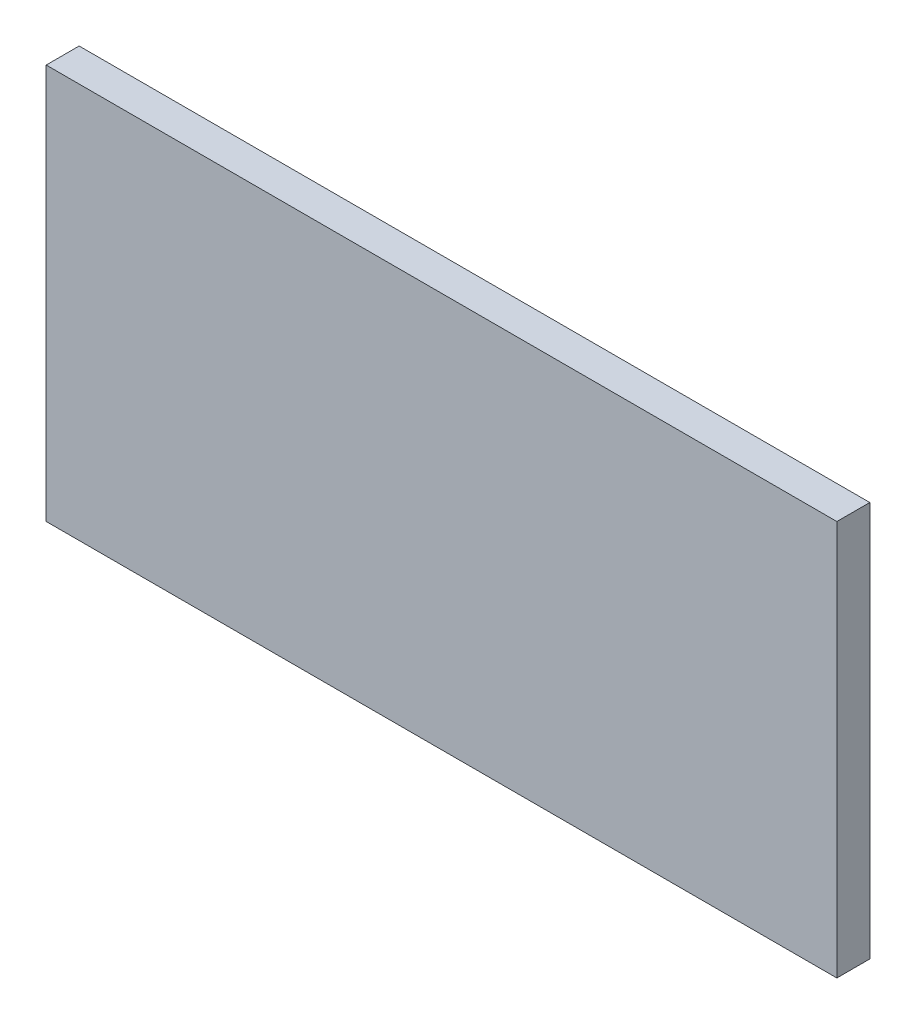
ISO-10303-21;
HEADER;
FILE_DESCRIPTION(('STEP AP214'),'2;1');
FILE_NAME('part.step','',(''),(''),'','','');
FILE_SCHEMA(('AUTOMOTIVE_DESIGN { 1 0 10303 214 1 1 1 1 }'));
ENDSEC;
DATA;
#1=APPLICATION_CONTEXT('core data for automotive mechanical design processes');
#2=APPLICATION_PROTOCOL_DEFINITION('international standard','automotive_design',2000,#1);
#3=PRODUCT_CONTEXT('',#1,'mechanical');
#4=PRODUCT('Part','Part','',(#3));
#5=PRODUCT_RELATED_PRODUCT_CATEGORY('part','',(#4));
#6=PRODUCT_DEFINITION_FORMATION('','',#4);
#7=PRODUCT_DEFINITION_CONTEXT('part definition',#1,'design');
#8=PRODUCT_DEFINITION('design','',#6,#7);
#9=PRODUCT_DEFINITION_SHAPE('','',#8);
#10=(LENGTH_UNIT() NAMED_UNIT(*) SI_UNIT(.MILLI.,.METRE.));
#11=(NAMED_UNIT(*) PLANE_ANGLE_UNIT() SI_UNIT($,.RADIAN.));
#12=(NAMED_UNIT(*) SI_UNIT($,.STERADIAN.) SOLID_ANGLE_UNIT());
#13=UNCERTAINTY_MEASURE_WITH_UNIT(LENGTH_MEASURE(1.E-05),#10,'distance_accuracy_value','');
#14=(GEOMETRIC_REPRESENTATION_CONTEXT(3) GLOBAL_UNCERTAINTY_ASSIGNED_CONTEXT((#13)) GLOBAL_UNIT_ASSIGNED_CONTEXT((#10,
#11,#12)) REPRESENTATION_CONTEXT('',''));
#15=CARTESIAN_POINT('',(0.,0.,0.));
#16=DIRECTION('',(0.,0.,1.));
#17=DIRECTION('',(1.,0.,0.));
#18=AXIS2_PLACEMENT_3D('',#15,#16,#17);
#19=CARTESIAN_POINT('',(-555.522580204597,0.,38.1));
#20=DIRECTION('',(0.,-1.,0.));
#21=DIRECTION('',(0.,0.,-1.));
#22=AXIS2_PLACEMENT_3D('',#19,#20,#21);
#23=PLANE('',#22);
#24=DIRECTION('',(-1.,0.,0.));
#25=VECTOR('',#24,1.);
#26=CARTESIAN_POINT('',(-555.522580204597,0.,0.));
#27=LINE('',#26,#25);
#28=CARTESIAN_POINT('',(0.,0.,0.));
#29=VERTEX_POINT('',#28);
#30=CARTESIAN_POINT('',(-914.4,0.,0.));
#31=VERTEX_POINT('',#30);
#32=EDGE_CURVE('E101',#29,#31,#27,.T.);
#33=ORIENTED_EDGE('',*,*,#32,.F.);
#34=DIRECTION('',(0.,0.,-1.));
#35=VECTOR('',#34,1.);
#36=CARTESIAN_POINT('',(0.,0.,38.1));
#37=LINE('',#36,#35);
#38=CARTESIAN_POINT('',(0.,0.,38.1));
#39=VERTEX_POINT('',#38);
#40=EDGE_CURVE('E10',#39,#29,#37,.T.);
#41=ORIENTED_EDGE('',*,*,#40,.F.);
#42=DIRECTION('',(-1.,0.,0.));
#43=VECTOR('',#42,1.);
#44=CARTESIAN_POINT('',(-555.522580204597,0.,38.1));
#45=LINE('',#44,#43);
#46=CARTESIAN_POINT('',(-914.4,0.,38.1));
#47=VERTEX_POINT('',#46);
#48=EDGE_CURVE('E79',#39,#47,#45,.T.);
#49=ORIENTED_EDGE('',*,*,#48,.T.);
#50=DIRECTION('',(0.,0.,-1.));
#51=VECTOR('',#50,1.);
#52=CARTESIAN_POINT('',(-914.4,0.,38.1));
#53=LINE('',#52,#51);
#54=EDGE_CURVE('E38',#47,#31,#53,.T.);
#55=ORIENTED_EDGE('',*,*,#54,.T.);
#56=EDGE_LOOP('',(#33,#41,#49,#55));
#57=FACE_BOUND('',#56,.T.);
#58=ADVANCED_FACE('F16',(#57),#23,.T.);
#59=CARTESIAN_POINT('',(0.,228.6,38.1));
#60=DIRECTION('',(-1.,0.,0.));
#61=DIRECTION('',(0.,0.,1.));
#62=AXIS2_PLACEMENT_3D('',#59,#60,#61);
#63=PLANE('',#62);
#64=DIRECTION('',(0.,1.,0.));
#65=VECTOR('',#64,1.);
#66=CARTESIAN_POINT('',(0.,228.6,0.));
#67=LINE('',#66,#65);
#68=CARTESIAN_POINT('',(0.,457.2,0.));
#69=VERTEX_POINT('',#68);
#70=EDGE_CURVE('E86',#29,#69,#67,.T.);
#71=ORIENTED_EDGE('',*,*,#70,.T.);
#72=DIRECTION('',(0.,0.,-1.));
#73=VECTOR('',#72,1.);
#74=CARTESIAN_POINT('',(0.,457.2,38.1));
#75=LINE('',#74,#73);
#76=CARTESIAN_POINT('',(0.,457.2,38.1));
#77=VERTEX_POINT('',#76);
#78=EDGE_CURVE('E25',#77,#69,#75,.T.);
#79=ORIENTED_EDGE('',*,*,#78,.F.);
#80=DIRECTION('',(0.,1.,0.));
#81=VECTOR('',#80,1.);
#82=CARTESIAN_POINT('',(0.,228.6,38.1));
#83=LINE('',#82,#81);
#84=EDGE_CURVE('E73',#39,#77,#83,.T.);
#85=ORIENTED_EDGE('',*,*,#84,.F.);
#86=ORIENTED_EDGE('',*,*,#40,.T.);
#87=EDGE_LOOP('',(#71,#79,#85,#86));
#88=FACE_BOUND('',#87,.T.);
#89=ADVANCED_FACE('F84',(#88),#63,.F.);
#90=CARTESIAN_POINT('',(-555.522580204597,457.2,38.1));
#91=DIRECTION('',(0.,-1.,0.));
#92=DIRECTION('',(0.,0.,-1.));
#93=AXIS2_PLACEMENT_3D('',#90,#91,#92);
#94=PLANE('',#93);
#95=DIRECTION('',(-1.,0.,0.));
#96=VECTOR('',#95,1.);
#97=CARTESIAN_POINT('',(-555.522580204597,457.2,0.));
#98=LINE('',#97,#96);
#99=CARTESIAN_POINT('',(-914.4,457.2,0.));
#100=VERTEX_POINT('',#99);
#101=EDGE_CURVE('E105',#69,#100,#98,.T.);
#102=ORIENTED_EDGE('',*,*,#101,.T.);
#103=DIRECTION('',(0.,0.,-1.));
#104=VECTOR('',#103,1.);
#105=CARTESIAN_POINT('',(-914.4,457.2,38.1));
#106=LINE('',#105,#104);
#107=CARTESIAN_POINT('',(-914.4,457.2,38.1));
#108=VERTEX_POINT('',#107);
#109=EDGE_CURVE('E57',#108,#100,#106,.T.);
#110=ORIENTED_EDGE('',*,*,#109,.F.);
#111=DIRECTION('',(-1.,0.,0.));
#112=VECTOR('',#111,1.);
#113=CARTESIAN_POINT('',(-555.522580204597,457.2,38.1));
#114=LINE('',#113,#112);
#115=EDGE_CURVE('E78',#77,#108,#114,.T.);
#116=ORIENTED_EDGE('',*,*,#115,.F.);
#117=ORIENTED_EDGE('',*,*,#78,.T.);
#118=EDGE_LOOP('',(#102,#110,#116,#117));
#119=FACE_BOUND('',#118,.T.);
#120=ADVANCED_FACE('F90',(#119),#94,.F.);
#121=CARTESIAN_POINT('',(-914.4,228.6,38.1));
#122=DIRECTION('',(-1.,0.,0.));
#123=DIRECTION('',(0.,-1.,0.));
#124=AXIS2_PLACEMENT_3D('',#121,#122,#123);
#125=PLANE('',#124);
#126=DIRECTION('',(0.,1.,0.));
#127=VECTOR('',#126,1.);
#128=CARTESIAN_POINT('',(-914.4,228.6,0.));
#129=LINE('',#128,#127);
#130=EDGE_CURVE('E107',#31,#100,#129,.T.);
#131=ORIENTED_EDGE('',*,*,#130,.F.);
#132=ORIENTED_EDGE('',*,*,#54,.F.);
#133=DIRECTION('',(0.,1.,0.));
#134=VECTOR('',#133,1.);
#135=CARTESIAN_POINT('',(-914.4,228.6,38.1));
#136=LINE('',#135,#134);
#137=EDGE_CURVE('E92',#47,#108,#136,.T.);
#138=ORIENTED_EDGE('',*,*,#137,.T.);
#139=ORIENTED_EDGE('',*,*,#109,.T.);
#140=EDGE_LOOP('',(#131,#132,#138,#139));
#141=FACE_BOUND('',#140,.T.);
#142=ADVANCED_FACE('F122',(#141),#125,.T.);
#143=CARTESIAN_POINT('',(-457.2,228.6,38.1));
#144=DIRECTION('',(0.,0.,1.));
#145=DIRECTION('',(1.,0.,0.));
#146=AXIS2_PLACEMENT_3D('',#143,#144,#145);
#147=PLANE('',#146);
#148=ORIENTED_EDGE('',*,*,#48,.F.);
#149=ORIENTED_EDGE('',*,*,#84,.T.);
#150=ORIENTED_EDGE('',*,*,#115,.T.);
#151=ORIENTED_EDGE('',*,*,#137,.F.);
#152=EDGE_LOOP('',(#148,#149,#150,#151));
#153=FACE_BOUND('',#152,.T.);
#154=ADVANCED_FACE('F75',(#153),#147,.T.);
#155=CARTESIAN_POINT('',(-457.2,228.6,0.));
#156=DIRECTION('',(0.,0.,1.));
#157=DIRECTION('',(1.,0.,0.));
#158=AXIS2_PLACEMENT_3D('',#155,#156,#157);
#159=PLANE('',#158);
#160=ORIENTED_EDGE('',*,*,#32,.T.);
#161=ORIENTED_EDGE('',*,*,#130,.T.);
#162=ORIENTED_EDGE('',*,*,#101,.F.);
#163=ORIENTED_EDGE('',*,*,#70,.F.);
#164=EDGE_LOOP('',(#160,#161,#162,#163));
#165=FACE_BOUND('',#164,.T.);
#166=ADVANCED_FACE('F129',(#165),#159,.F.);
#167=CLOSED_SHELL('',(#58,#89,#120,#142,#154,#166));
#168=MANIFOLD_SOLID_BREP('B1',#167);
#169=ADVANCED_BREP_SHAPE_REPRESENTATION('',(#18,#168),#14);
#170=SHAPE_DEFINITION_REPRESENTATION(#9,#169);
ENDSEC;
END-ISO-10303-21;
